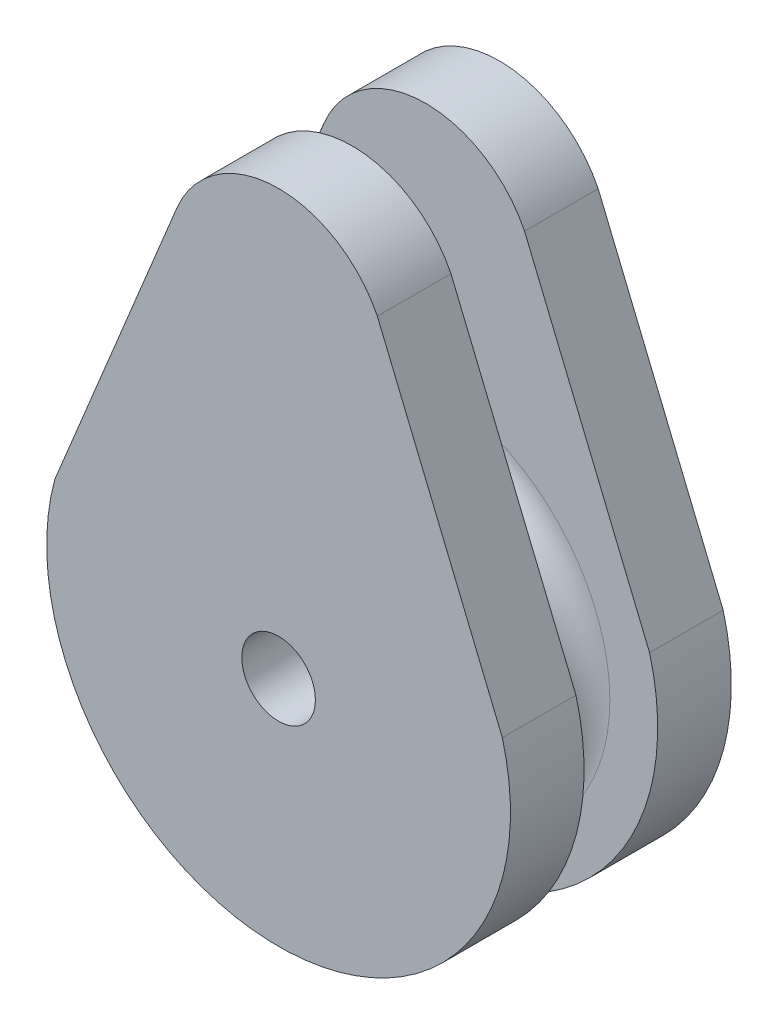
ISO-10303-21;
HEADER;
FILE_DESCRIPTION(('STEP AP214'),'2;1');
FILE_NAME('part.step','',(''),(''),'','','');
FILE_SCHEMA(('AUTOMOTIVE_DESIGN { 1 0 10303 214 1 1 1 1 }'));
ENDSEC;
DATA;
#1=APPLICATION_CONTEXT('core data for automotive mechanical design processes');
#2=APPLICATION_PROTOCOL_DEFINITION('international standard','automotive_design',2000,#1);
#3=PRODUCT_CONTEXT('',#1,'mechanical');
#4=PRODUCT('Part','Part','',(#3));
#5=PRODUCT_RELATED_PRODUCT_CATEGORY('part','',(#4));
#6=PRODUCT_DEFINITION_FORMATION('','',#4);
#7=PRODUCT_DEFINITION_CONTEXT('part definition',#1,'design');
#8=PRODUCT_DEFINITION('design','',#6,#7);
#9=PRODUCT_DEFINITION_SHAPE('','',#8);
#10=(LENGTH_UNIT() NAMED_UNIT(*) SI_UNIT(.MILLI.,.METRE.));
#11=(NAMED_UNIT(*) PLANE_ANGLE_UNIT() SI_UNIT($,.RADIAN.));
#12=(NAMED_UNIT(*) SI_UNIT($,.STERADIAN.) SOLID_ANGLE_UNIT());
#13=UNCERTAINTY_MEASURE_WITH_UNIT(LENGTH_MEASURE(1.E-05),#10,'distance_accuracy_value','');
#14=(GEOMETRIC_REPRESENTATION_CONTEXT(3) GLOBAL_UNCERTAINTY_ASSIGNED_CONTEXT((#13)) GLOBAL_UNIT_ASSIGNED_CONTEXT((#10,
#11,#12)) REPRESENTATION_CONTEXT('',''));
#15=CARTESIAN_POINT('',(0.,0.,0.));
#16=DIRECTION('',(0.,0.,1.));
#17=DIRECTION('',(1.,0.,0.));
#18=AXIS2_PLACEMENT_3D('',#15,#16,#17);
#19=CARTESIAN_POINT('',(-11.5571687393774,4.76447373781121,4.));
#20=DIRECTION('',(-0.924519185557827,0.381135508101111,0.));
#21=DIRECTION('',(-0.381135508101111,-0.924519185557827,0.));
#22=AXIS2_PLACEMENT_3D('',#19,#20,#21);
#23=PLANE('',#22);
#24=DIRECTION('',(0.381135508101111,0.924519185557827,0.));
#25=VECTOR('',#24,1.);
#26=CARTESIAN_POINT('',(-11.5571687393774,4.76447373781121,0.));
#27=LINE('',#26,#25);
#28=CARTESIAN_POINT('',(-12.1587885412813,3.30512650447984,0.));
#29=VERTEX_POINT('',#28);
#30=CARTESIAN_POINT('',(-5.53575702101247,19.3705929249384,0.));
#31=VERTEX_POINT('',#30);
#32=EDGE_CURVE('E131',#29,#31,#27,.T.);
#33=ORIENTED_EDGE('',*,*,#32,.F.);
#34=DIRECTION('',(0.,0.,-1.));
#35=VECTOR('',#34,1.);
#36=CARTESIAN_POINT('',(-12.1587885412813,3.30512650447984,4.));
#37=LINE('',#36,#35);
#38=CARTESIAN_POINT('',(-12.1587885412813,3.30512650447984,4.));
#39=VERTEX_POINT('',#38);
#40=EDGE_CURVE('E11',#39,#29,#37,.T.);
#41=ORIENTED_EDGE('',*,*,#40,.F.);
#42=DIRECTION('',(0.381135508101111,0.924519185557827,0.));
#43=VECTOR('',#42,1.);
#44=CARTESIAN_POINT('',(-11.5571687393774,4.76447373781121,4.));
#45=LINE('',#44,#43);
#46=CARTESIAN_POINT('',(-5.53575702101247,19.3705929249384,4.));
#47=VERTEX_POINT('',#46);
#48=EDGE_CURVE('E156',#39,#47,#45,.T.);
#49=ORIENTED_EDGE('',*,*,#48,.T.);
#50=DIRECTION('',(0.,0.,-1.));
#51=VECTOR('',#50,1.);
#52=CARTESIAN_POINT('',(-5.53575702101247,19.3705929249384,4.));
#53=LINE('',#52,#51);
#54=EDGE_CURVE('E81',#47,#31,#53,.T.);
#55=ORIENTED_EDGE('',*,*,#54,.T.);
#56=EDGE_LOOP('',(#33,#41,#49,#55));
#57=FACE_BOUND('',#56,.T.);
#58=ADVANCED_FACE('F42',(#57),#23,.T.);
#59=CARTESIAN_POINT('',(0.,0.,4.));
#60=DIRECTION('',(0.,0.,-1.));
#61=DIRECTION('',(-1.,0.,0.));
#62=AXIS2_PLACEMENT_3D('',#59,#60,#61);
#63=CYLINDRICAL_SURFACE('',#62,12.6);
#64=CARTESIAN_POINT('',(0.,0.,0.));
#65=DIRECTION('',(0.,0.,1.));
#66=DIRECTION('',(1.,0.,0.));
#67=AXIS2_PLACEMENT_3D('',#64,#65,#66);
#68=CIRCLE('',#67,12.6);
#69=CARTESIAN_POINT('',(12.1587885412842,3.30512650446916,0.));
#70=VERTEX_POINT('',#69);
#71=EDGE_CURVE('E167',#29,#70,#68,.T.);
#72=ORIENTED_EDGE('',*,*,#71,.T.);
#73=DIRECTION('',(0.,0.,-1.));
#74=VECTOR('',#73,1.);
#75=CARTESIAN_POINT('',(12.1587885412842,3.30512650446916,4.));
#76=LINE('',#75,#74);
#77=CARTESIAN_POINT('',(12.1587885412842,3.30512650446916,4.));
#78=VERTEX_POINT('',#77);
#79=EDGE_CURVE('E50',#78,#70,#76,.T.);
#80=ORIENTED_EDGE('',*,*,#79,.F.);
#81=CARTESIAN_POINT('',(0.,0.,4.));
#82=DIRECTION('',(0.,0.,1.));
#83=DIRECTION('',(1.,0.,0.));
#84=AXIS2_PLACEMENT_3D('',#81,#82,#83);
#85=CIRCLE('',#84,12.6);
#86=EDGE_CURVE('E158',#39,#78,#85,.T.);
#87=ORIENTED_EDGE('',*,*,#86,.F.);
#88=ORIENTED_EDGE('',*,*,#40,.T.);
#89=EDGE_LOOP('',(#72,#80,#87,#88));
#90=FACE_BOUND('',#89,.T.);
#91=ADVANCED_FACE('F181',(#90),#63,.T.);
#92=CARTESIAN_POINT('',(11.552265064586,4.77308969393456,4.));
#93=DIRECTION('',(0.924219022472664,0.381862800623043,0.));
#94=DIRECTION('',(-0.381862800623043,0.924219022472664,0.));
#95=AXIS2_PLACEMENT_3D('',#92,#93,#94);
#96=PLANE('',#95);
#97=DIRECTION('',(0.381862800623043,-0.924219022472664,0.));
#98=VECTOR('',#97,1.);
#99=CARTESIAN_POINT('',(11.552265064586,4.77308969393456,0.));
#100=LINE('',#99,#98);
#101=CARTESIAN_POINT('',(5.36688362223662,19.7435114813971,0.));
#102=VERTEX_POINT('',#101);
#103=EDGE_CURVE('E170',#102,#70,#100,.T.);
#104=ORIENTED_EDGE('',*,*,#103,.F.);
#105=DIRECTION('',(0.,0.,-1.));
#106=VECTOR('',#105,1.);
#107=CARTESIAN_POINT('',(5.36688362223662,19.7435114813971,4.));
#108=LINE('',#107,#106);
#109=CARTESIAN_POINT('',(5.36688362223662,19.7435114813971,4.));
#110=VERTEX_POINT('',#109);
#111=EDGE_CURVE('E74',#110,#102,#108,.T.);
#112=ORIENTED_EDGE('',*,*,#111,.F.);
#113=DIRECTION('',(0.381862800623043,-0.924219022472664,0.));
#114=VECTOR('',#113,1.);
#115=CARTESIAN_POINT('',(11.552265064586,4.77308969393456,4.));
#116=LINE('',#115,#114);
#117=EDGE_CURVE('E161',#110,#78,#116,.T.);
#118=ORIENTED_EDGE('',*,*,#117,.T.);
#119=ORIENTED_EDGE('',*,*,#79,.T.);
#120=EDGE_LOOP('',(#104,#112,#118,#119));
#121=FACE_BOUND('',#120,.T.);
#122=ADVANCED_FACE('F178',(#121),#96,.T.);
#123=CARTESIAN_POINT('',(0.,17.0884622802889,4.));
#124=DIRECTION('',(0.,0.,-1.));
#125=DIRECTION('',(-1.,0.,0.));
#126=AXIS2_PLACEMENT_3D('',#123,#124,#125);
#127=CYLINDRICAL_SURFACE('',#126,5.98771459531406);
#128=CARTESIAN_POINT('',(0.,17.0884622802889,0.));
#129=DIRECTION('',(0.,0.,1.));
#130=DIRECTION('',(1.,0.,0.));
#131=AXIS2_PLACEMENT_3D('',#128,#129,#130);
#132=CIRCLE('',#131,5.98771459531406);
#133=EDGE_CURVE('E159',#102,#31,#132,.T.);
#134=ORIENTED_EDGE('',*,*,#133,.T.);
#135=ORIENTED_EDGE('',*,*,#54,.F.);
#136=CARTESIAN_POINT('',(0.,17.0884622802889,4.));
#137=DIRECTION('',(0.,0.,1.));
#138=DIRECTION('',(1.,0.,0.));
#139=AXIS2_PLACEMENT_3D('',#136,#137,#138);
#140=CIRCLE('',#139,5.98771459531406);
#141=EDGE_CURVE('E58',#110,#47,#140,.T.);
#142=ORIENTED_EDGE('',*,*,#141,.F.);
#143=ORIENTED_EDGE('',*,*,#111,.T.);
#144=EDGE_LOOP('',(#134,#135,#142,#143));
#145=FACE_BOUND('',#144,.T.);
#146=ADVANCED_FACE('F184',(#145),#127,.T.);
#147=CARTESIAN_POINT('',(0.,0.,4.));
#148=DIRECTION('',(0.,0.,1.));
#149=DIRECTION('',(1.,0.,0.));
#150=AXIS2_PLACEMENT_3D('',#147,#148,#149);
#151=PLANE('',#150);
#152=CARTESIAN_POINT('',(0.,0.,4.));
#153=DIRECTION('',(0.,0.,1.));
#154=DIRECTION('',(1.,0.,0.));
#155=AXIS2_PLACEMENT_3D('',#152,#153,#154);
#156=CIRCLE('',#155,10.);
#157=CARTESIAN_POINT('',(10.,0.,4.));
#158=VERTEX_POINT('',#157);
#159=EDGE_CURVE('E145',#158,#158,#156,.T.);
#160=ORIENTED_EDGE('',*,*,#159,.F.);
#161=EDGE_LOOP('',(#160));
#162=FACE_BOUND('',#161,.T.);
#163=ORIENTED_EDGE('',*,*,#48,.F.);
#164=ORIENTED_EDGE('',*,*,#86,.T.);
#165=ORIENTED_EDGE('',*,*,#117,.F.);
#166=ORIENTED_EDGE('',*,*,#141,.T.);
#167=EDGE_LOOP('',(#163,#164,#165,#166));
#168=FACE_BOUND('',#167,.T.);
#169=ADVANCED_FACE('F185',(#162,#168),#151,.T.);
#170=CARTESIAN_POINT('',(0.,0.,0.));
#171=DIRECTION('',(0.,0.,1.));
#172=DIRECTION('',(1.,0.,0.));
#173=AXIS2_PLACEMENT_3D('',#170,#171,#172);
#174=PLANE('',#173);
#175=CARTESIAN_POINT('',(0.,0.,0.));
#176=DIRECTION('',(0.,0.,-1.));
#177=DIRECTION('',(-1.,0.,0.));
#178=AXIS2_PLACEMENT_3D('',#175,#176,#177);
#179=CIRCLE('',#178,2.);
#180=CARTESIAN_POINT('',(-2.,0.,0.));
#181=VERTEX_POINT('',#180);
#182=EDGE_CURVE('E311',#181,#181,#179,.T.);
#183=ORIENTED_EDGE('',*,*,#182,.F.);
#184=EDGE_LOOP('',(#183));
#185=FACE_BOUND('',#184,.T.);
#186=ORIENTED_EDGE('',*,*,#32,.T.);
#187=ORIENTED_EDGE('',*,*,#133,.F.);
#188=ORIENTED_EDGE('',*,*,#103,.T.);
#189=ORIENTED_EDGE('',*,*,#71,.F.);
#190=EDGE_LOOP('',(#186,#187,#188,#189));
#191=FACE_BOUND('',#190,.T.);
#192=ADVANCED_FACE('F183',(#185,#191),#174,.F.);
#193=CARTESIAN_POINT('',(0.,0.,6.));
#194=DIRECTION('',(0.,0.,-1.));
#195=DIRECTION('',(-1.,0.,0.));
#196=AXIS2_PLACEMENT_3D('',#193,#194,#195);
#197=TOROIDAL_SURFACE('',#196,10.,2.);
#198=ORIENTED_EDGE('',*,*,#159,.T.);
#199=EDGE_LOOP('',(#198));
#200=FACE_BOUND('',#199,.T.);
#201=CARTESIAN_POINT('',(0.,0.,8.));
#202=DIRECTION('',(0.,0.,-1.));
#203=DIRECTION('',(-1.,0.,0.));
#204=AXIS2_PLACEMENT_3D('',#201,#202,#203);
#205=CIRCLE('',#204,10.);
#206=CARTESIAN_POINT('',(-10.,0.,8.));
#207=VERTEX_POINT('',#206);
#208=EDGE_CURVE('E316',#207,#207,#205,.T.);
#209=ORIENTED_EDGE('',*,*,#208,.T.);
#210=EDGE_LOOP('',(#209));
#211=FACE_BOUND('',#210,.T.);
#212=ADVANCED_FACE('F193',(#200,#211),#197,.F.);
#213=CARTESIAN_POINT('',(0.,0.,12.));
#214=DIRECTION('',(0.,0.,-1.));
#215=DIRECTION('',(1.,0.,0.));
#216=AXIS2_PLACEMENT_3D('',#213,#214,#215);
#217=PLANE('',#216);
#218=CARTESIAN_POINT('',(0.,0.,12.));
#219=DIRECTION('',(0.,0.,1.));
#220=DIRECTION('',(1.,0.,0.));
#221=AXIS2_PLACEMENT_3D('',#218,#219,#220);
#222=CIRCLE('',#221,2.);
#223=CARTESIAN_POINT('',(2.,0.,12.));
#224=VERTEX_POINT('',#223);
#225=EDGE_CURVE('E314',#224,#224,#222,.T.);
#226=ORIENTED_EDGE('',*,*,#225,.F.);
#227=EDGE_LOOP('',(#226));
#228=FACE_BOUND('',#227,.T.);
#229=DIRECTION('',(0.381135508101111,0.924519185557827,0.));
#230=VECTOR('',#229,1.);
#231=CARTESIAN_POINT('',(-11.5571687393774,4.76447373781121,12.));
#232=LINE('',#231,#230);
#233=CARTESIAN_POINT('',(-12.1587885412813,3.30512650447984,12.));
#234=VERTEX_POINT('',#233);
#235=CARTESIAN_POINT('',(-5.53575702101247,19.3705929249384,12.));
#236=VERTEX_POINT('',#235);
#237=EDGE_CURVE('E127',#234,#236,#232,.T.);
#238=ORIENTED_EDGE('',*,*,#237,.F.);
#239=CARTESIAN_POINT('',(0.,0.,12.));
#240=DIRECTION('',(0.,0.,1.));
#241=DIRECTION('',(1.,0.,0.));
#242=AXIS2_PLACEMENT_3D('',#239,#240,#241);
#243=CIRCLE('',#242,12.6);
#244=CARTESIAN_POINT('',(12.1587885412842,3.30512650446916,12.));
#245=VERTEX_POINT('',#244);
#246=EDGE_CURVE('E121',#234,#245,#243,.T.);
#247=ORIENTED_EDGE('',*,*,#246,.T.);
#248=DIRECTION('',(0.381862800623043,-0.924219022472664,0.));
#249=VECTOR('',#248,1.);
#250=CARTESIAN_POINT('',(11.552265064586,4.77308969393456,12.));
#251=LINE('',#250,#249);
#252=CARTESIAN_POINT('',(5.36688362223662,19.7435114813971,12.));
#253=VERTEX_POINT('',#252);
#254=EDGE_CURVE('E147',#253,#245,#251,.T.);
#255=ORIENTED_EDGE('',*,*,#254,.F.);
#256=CARTESIAN_POINT('',(0.,17.0884622802889,12.));
#257=DIRECTION('',(0.,0.,1.));
#258=DIRECTION('',(1.,0.,0.));
#259=AXIS2_PLACEMENT_3D('',#256,#257,#258);
#260=CIRCLE('',#259,5.98771459531406);
#261=EDGE_CURVE('E144',#253,#236,#260,.T.);
#262=ORIENTED_EDGE('',*,*,#261,.T.);
#263=EDGE_LOOP('',(#238,#247,#255,#262));
#264=FACE_BOUND('',#263,.T.);
#265=ADVANCED_FACE('F250',(#228,#264),#217,.F.);
#266=CARTESIAN_POINT('',(0.,0.,8.));
#267=DIRECTION('',(0.,0.,1.));
#268=DIRECTION('',(1.,0.,0.));
#269=AXIS2_PLACEMENT_3D('',#266,#267,#268);
#270=CYLINDRICAL_SURFACE('',#269,12.6);
#271=ORIENTED_EDGE('',*,*,#246,.F.);
#272=DIRECTION('',(0.,0.,1.));
#273=VECTOR('',#272,1.);
#274=CARTESIAN_POINT('',(-12.1587885412813,3.30512650447984,8.));
#275=LINE('',#274,#273);
#276=CARTESIAN_POINT('',(-12.1587885412813,3.30512650447984,8.));
#277=VERTEX_POINT('',#276);
#278=EDGE_CURVE('E142',#277,#234,#275,.T.);
#279=ORIENTED_EDGE('',*,*,#278,.F.);
#280=CARTESIAN_POINT('',(0.,0.,8.));
#281=DIRECTION('',(0.,0.,1.));
#282=DIRECTION('',(1.,0.,0.));
#283=AXIS2_PLACEMENT_3D('',#280,#281,#282);
#284=CIRCLE('',#283,12.6);
#285=CARTESIAN_POINT('',(12.1587885412842,3.30512650446916,8.));
#286=VERTEX_POINT('',#285);
#287=EDGE_CURVE('E119',#277,#286,#284,.T.);
#288=ORIENTED_EDGE('',*,*,#287,.T.);
#289=DIRECTION('',(0.,0.,1.));
#290=VECTOR('',#289,1.);
#291=CARTESIAN_POINT('',(12.1587885412842,3.30512650446916,8.));
#292=LINE('',#291,#290);
#293=EDGE_CURVE('E153',#286,#245,#292,.T.);
#294=ORIENTED_EDGE('',*,*,#293,.T.);
#295=EDGE_LOOP('',(#271,#279,#288,#294));
#296=FACE_BOUND('',#295,.T.);
#297=ADVANCED_FACE('F241',(#296),#270,.T.);
#298=CARTESIAN_POINT('',(11.552265064586,4.77308969393456,8.));
#299=DIRECTION('',(-0.924219022472664,-0.381862800623043,0.));
#300=DIRECTION('',(0.381862800623043,-0.924219022472664,0.));
#301=AXIS2_PLACEMENT_3D('',#298,#299,#300);
#302=PLANE('',#301);
#303=ORIENTED_EDGE('',*,*,#254,.T.);
#304=ORIENTED_EDGE('',*,*,#293,.F.);
#305=DIRECTION('',(0.381862800623043,-0.924219022472664,0.));
#306=VECTOR('',#305,1.);
#307=CARTESIAN_POINT('',(11.552265064586,4.77308969393456,8.));
#308=LINE('',#307,#306);
#309=CARTESIAN_POINT('',(5.36688362223662,19.7435114813971,8.));
#310=VERTEX_POINT('',#309);
#311=EDGE_CURVE('E136',#310,#286,#308,.T.);
#312=ORIENTED_EDGE('',*,*,#311,.F.);
#313=DIRECTION('',(0.,0.,1.));
#314=VECTOR('',#313,1.);
#315=CARTESIAN_POINT('',(5.36688362223662,19.7435114813971,8.));
#316=LINE('',#315,#314);
#317=EDGE_CURVE('E132',#310,#253,#316,.T.);
#318=ORIENTED_EDGE('',*,*,#317,.T.);
#319=EDGE_LOOP('',(#303,#304,#312,#318));
#320=FACE_BOUND('',#319,.T.);
#321=ADVANCED_FACE('F232',(#320),#302,.F.);
#322=CARTESIAN_POINT('',(0.,17.0884622802889,8.));
#323=DIRECTION('',(0.,0.,1.));
#324=DIRECTION('',(1.,0.,0.));
#325=AXIS2_PLACEMENT_3D('',#322,#323,#324);
#326=CYLINDRICAL_SURFACE('',#325,5.98771459531406);
#327=ORIENTED_EDGE('',*,*,#261,.F.);
#328=ORIENTED_EDGE('',*,*,#317,.F.);
#329=CARTESIAN_POINT('',(0.,17.0884622802889,8.));
#330=DIRECTION('',(0.,0.,1.));
#331=DIRECTION('',(1.,0.,0.));
#332=AXIS2_PLACEMENT_3D('',#329,#330,#331);
#333=CIRCLE('',#332,5.98771459531406);
#334=CARTESIAN_POINT('',(-5.53575702101247,19.3705929249384,8.));
#335=VERTEX_POINT('',#334);
#336=EDGE_CURVE('E117',#310,#335,#333,.T.);
#337=ORIENTED_EDGE('',*,*,#336,.T.);
#338=DIRECTION('',(0.,0.,1.));
#339=VECTOR('',#338,1.);
#340=CARTESIAN_POINT('',(-5.53575702101247,19.3705929249384,8.));
#341=LINE('',#340,#339);
#342=EDGE_CURVE('E124',#335,#236,#341,.T.);
#343=ORIENTED_EDGE('',*,*,#342,.T.);
#344=EDGE_LOOP('',(#327,#328,#337,#343));
#345=FACE_BOUND('',#344,.T.);
#346=ADVANCED_FACE('F134',(#345),#326,.T.);
#347=CARTESIAN_POINT('',(-11.5571687393774,4.76447373781121,8.));
#348=DIRECTION('',(0.924519185557827,-0.381135508101111,0.));
#349=DIRECTION('',(0.381135508101111,0.924519185557827,0.));
#350=AXIS2_PLACEMENT_3D('',#347,#348,#349);
#351=PLANE('',#350);
#352=ORIENTED_EDGE('',*,*,#237,.T.);
#353=ORIENTED_EDGE('',*,*,#342,.F.);
#354=DIRECTION('',(0.381135508101111,0.924519185557827,0.));
#355=VECTOR('',#354,1.);
#356=CARTESIAN_POINT('',(-11.5571687393774,4.76447373781121,8.));
#357=LINE('',#356,#355);
#358=EDGE_CURVE('E113',#277,#335,#357,.T.);
#359=ORIENTED_EDGE('',*,*,#358,.F.);
#360=ORIENTED_EDGE('',*,*,#278,.T.);
#361=EDGE_LOOP('',(#352,#353,#359,#360));
#362=FACE_BOUND('',#361,.T.);
#363=ADVANCED_FACE('F125',(#362),#351,.F.);
#364=CARTESIAN_POINT('',(0.,0.,8.));
#365=DIRECTION('',(0.,0.,-1.));
#366=DIRECTION('',(1.,0.,0.));
#367=AXIS2_PLACEMENT_3D('',#364,#365,#366);
#368=PLANE('',#367);
#369=ORIENTED_EDGE('',*,*,#208,.F.);
#370=EDGE_LOOP('',(#369));
#371=FACE_BOUND('',#370,.T.);
#372=ORIENTED_EDGE('',*,*,#358,.T.);
#373=ORIENTED_EDGE('',*,*,#336,.F.);
#374=ORIENTED_EDGE('',*,*,#311,.T.);
#375=ORIENTED_EDGE('',*,*,#287,.F.);
#376=EDGE_LOOP('',(#372,#373,#374,#375));
#377=FACE_BOUND('',#376,.T.);
#378=ADVANCED_FACE('F115',(#371,#377),#368,.T.);
#379=CARTESIAN_POINT('',(0.,0.,1.));
#380=DIRECTION('',(0.,0.,-1.));
#381=DIRECTION('',(-1.,0.,0.));
#382=AXIS2_PLACEMENT_3D('',#379,#380,#381);
#383=CYLINDRICAL_SURFACE('',#382,2.);
#384=ORIENTED_EDGE('',*,*,#182,.T.);
#385=EDGE_LOOP('',(#384));
#386=FACE_BOUND('',#385,.T.);
#387=ORIENTED_EDGE('',*,*,#225,.T.);
#388=EDGE_LOOP('',(#387));
#389=FACE_BOUND('',#388,.T.);
#390=ADVANCED_FACE('F268',(#386,#389),#383,.F.);
#391=CLOSED_SHELL('',(#58,#91,#122,#146,#169,#192,#212,#265,#297,#321,#346,#363,#378,#390));
#392=MANIFOLD_SOLID_BREP('B2',#391);
#393=ADVANCED_BREP_SHAPE_REPRESENTATION('',(#18,#392),#14);
#394=SHAPE_DEFINITION_REPRESENTATION(#9,#393);
ENDSEC;
END-ISO-10303-21;
